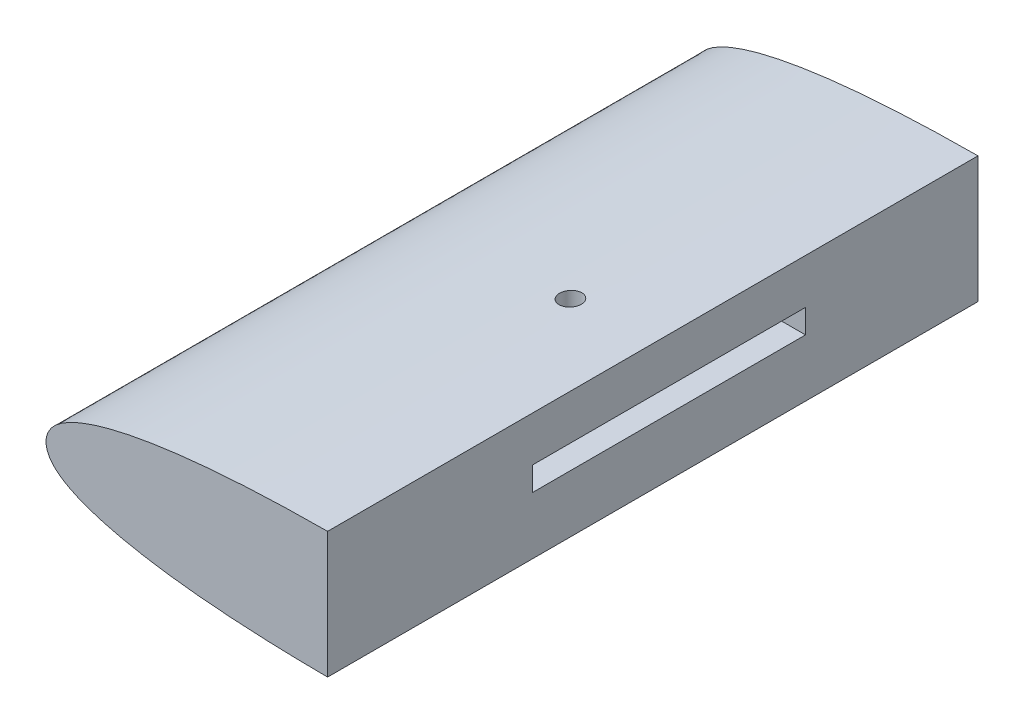
ISO-10303-21;
HEADER;
FILE_DESCRIPTION(('STEP AP214'),'2;1');
FILE_NAME('part.step','',(''),(''),'','','');
FILE_SCHEMA(('AUTOMOTIVE_DESIGN { 1 0 10303 214 1 1 1 1 }'));
ENDSEC;
DATA;
#1=APPLICATION_CONTEXT('core data for automotive mechanical design processes');
#2=APPLICATION_PROTOCOL_DEFINITION('international standard','automotive_design',2000,#1);
#3=PRODUCT_CONTEXT('',#1,'mechanical');
#4=PRODUCT('Part','Part','',(#3));
#5=PRODUCT_RELATED_PRODUCT_CATEGORY('part','',(#4));
#6=PRODUCT_DEFINITION_FORMATION('','',#4);
#7=PRODUCT_DEFINITION_CONTEXT('part definition',#1,'design');
#8=PRODUCT_DEFINITION('design','',#6,#7);
#9=PRODUCT_DEFINITION_SHAPE('','',#8);
#10=(LENGTH_UNIT() NAMED_UNIT(*) SI_UNIT(.MILLI.,.METRE.));
#11=(NAMED_UNIT(*) PLANE_ANGLE_UNIT() SI_UNIT($,.RADIAN.));
#12=(NAMED_UNIT(*) SI_UNIT($,.STERADIAN.) SOLID_ANGLE_UNIT());
#13=UNCERTAINTY_MEASURE_WITH_UNIT(LENGTH_MEASURE(1.E-05),#10,'distance_accuracy_value','');
#14=(GEOMETRIC_REPRESENTATION_CONTEXT(3) GLOBAL_UNCERTAINTY_ASSIGNED_CONTEXT((#13)) GLOBAL_UNIT_ASSIGNED_CONTEXT((#10,
#11,#12)) REPRESENTATION_CONTEXT('',''));
#15=CARTESIAN_POINT('',(0.,0.,0.));
#16=DIRECTION('',(0.,0.,1.));
#17=DIRECTION('',(1.,0.,0.));
#18=AXIS2_PLACEMENT_3D('',#15,#16,#17);
#19=CARTESIAN_POINT('',(64.9490601417906,14.5585390016991,150.01));
#20=DIRECTION('',(1.,0.,0.));
#21=DIRECTION('',(0.,0.,-1.));
#22=AXIS2_PLACEMENT_3D('',#19,#20,#21);
#23=PLANE('',#22);
#24=DIRECTION('',(0.,-1.,0.));
#25=VECTOR('',#24,1.);
#26=CARTESIAN_POINT('',(64.9490601417906,4.1825749587571,102.784488112027));
#27=LINE('',#26,#25);
#28=CARTESIAN_POINT('',(64.9490601417906,4.1825749587571,102.784488112027));
#29=VERTEX_POINT('',#28);
#30=CARTESIAN_POINT('',(64.9490601417906,-1.3174250412429,102.784488112027));
#31=VERTEX_POINT('',#30);
#32=EDGE_CURVE('E56',#29,#31,#27,.T.);
#33=ORIENTED_EDGE('',*,*,#32,.F.);
#34=DIRECTION('',(0.,0.,-1.));
#35=VECTOR('',#34,1.);
#36=CARTESIAN_POINT('',(64.9490601417906,4.1825749587571,102.784488112027));
#37=LINE('',#36,#35);
#38=CARTESIAN_POINT('',(64.9490601417906,4.1825749587571,39.7844881120272));
#39=VERTEX_POINT('',#38);
#40=EDGE_CURVE('E115',#29,#39,#37,.T.);
#41=ORIENTED_EDGE('',*,*,#40,.T.);
#42=DIRECTION('',(0.,-1.,0.));
#43=VECTOR('',#42,1.);
#44=CARTESIAN_POINT('',(64.9490601417906,4.1825749587571,39.7844881120272));
#45=LINE('',#44,#43);
#46=CARTESIAN_POINT('',(64.9490601417906,-1.3174250412429,39.7844881120272));
#47=VERTEX_POINT('',#46);
#48=EDGE_CURVE('E119',#39,#47,#45,.T.);
#49=ORIENTED_EDGE('',*,*,#48,.T.);
#50=DIRECTION('',(0.,0.,-1.));
#51=VECTOR('',#50,1.);
#52=CARTESIAN_POINT('',(64.9490601417906,-1.3174250412429,102.784488112027));
#53=LINE('',#52,#51);
#54=EDGE_CURVE('E135',#31,#47,#53,.T.);
#55=ORIENTED_EDGE('',*,*,#54,.F.);
#56=EDGE_LOOP('',(#33,#41,#49,#55));
#57=FACE_BOUND('',#56,.T.);
#58=DIRECTION('',(0.,1.,0.));
#59=VECTOR('',#58,1.);
#60=CARTESIAN_POINT('',(64.9490601417906,2.03901631355602E-13,150.));
#61=LINE('',#60,#59);
#62=CARTESIAN_POINT('',(64.9490601417907,-14.5585390016991,150.));
#63=VERTEX_POINT('',#62);
#64=CARTESIAN_POINT('',(64.9490601417906,14.5585390016991,150.));
#65=VERTEX_POINT('',#64);
#66=EDGE_CURVE('E63',#63,#65,#61,.T.);
#67=ORIENTED_EDGE('',*,*,#66,.F.);
#68=DIRECTION('',(0.,0.,-1.));
#69=VECTOR('',#68,1.);
#70=CARTESIAN_POINT('',(64.9490601417906,-14.5585390016991,150.));
#71=LINE('',#70,#69);
#72=CARTESIAN_POINT('',(64.9490601417907,-14.5585390016991,0.));
#73=VERTEX_POINT('',#72);
#74=EDGE_CURVE('E213',#63,#73,#71,.T.);
#75=ORIENTED_EDGE('',*,*,#74,.T.);
#76=DIRECTION('',(0.,1.,0.));
#77=VECTOR('',#76,1.);
#78=CARTESIAN_POINT('',(64.9490601417906,2.03901631355602E-13,0.));
#79=LINE('',#78,#77);
#80=CARTESIAN_POINT('',(64.9490601417906,14.5585390016991,0.));
#81=VERTEX_POINT('',#80);
#82=EDGE_CURVE('E144',#73,#81,#79,.T.);
#83=ORIENTED_EDGE('',*,*,#82,.T.);
#84=DIRECTION('',(0.,0.,-1.));
#85=VECTOR('',#84,1.);
#86=CARTESIAN_POINT('',(64.9490601417906,14.5585390016991,150.));
#87=LINE('',#86,#85);
#88=EDGE_CURVE('E210',#81,#65,#87,.F.);
#89=ORIENTED_EDGE('',*,*,#88,.T.);
#90=EDGE_LOOP('',(#67,#75,#83,#89));
#91=FACE_BOUND('',#90,.T.);
#92=ADVANCED_FACE('F39',(#57,#91),#23,.T.);
#93=CARTESIAN_POINT('',(0.,2.03901631355602E-13,0.));
#94=DIRECTION('',(0.,0.,1.));
#95=DIRECTION('',(1.,0.,0.));
#96=AXIS2_PLACEMENT_3D('',#93,#94,#95);
#97=PLANE('',#96);
#98=ORIENTED_EDGE('',*,*,#82,.F.);
#99=CARTESIAN_POINT('',(300.,0.615,0.));
#100=CARTESIAN_POINT('',(297.904984083785,0.75175754308859,0.));
#101=CARTESIAN_POINT('',(292.317834146917,1.11647310076999,0.));
#102=CARTESIAN_POINT('',(283.239167485548,1.717548993117,0.));
#103=CARTESIAN_POINT('',(272.76385107331,2.40173412883395,0.));
#104=CARTESIAN_POINT('',(262.289009769235,3.09314837150869,0.));
#105=CARTESIAN_POINT('',(251.814135815064,3.78406655140474,0.));
#106=CARTESIAN_POINT('',(241.337843931188,4.46862529985887,0.));
#107=CARTESIAN_POINT('',(230.862161265605,5.16145375899976,0.));
#108=CARTESIAN_POINT('',(220.385838201456,5.84553816170969,0.));
#109=CARTESIAN_POINT('',(209.911154414138,6.53834924156426,0.));
#110=CARTESIAN_POINT('',(199.435845553229,7.22265025326787,0.));
#111=CARTESIAN_POINT('',(188.961161961777,7.91546436518573,0.));
#112=CARTESIAN_POINT('',(178.484838114123,8.59953663901671,0.));
#113=CARTESIAN_POINT('',(168.010154067309,9.29234472619852,0.));
#114=CARTESIAN_POINT('',(157.534847027507,9.97666983236351,0.));
#115=CARTESIAN_POINT('',(147.06015640951,10.6693905377389,0.));
#116=CARTESIAN_POINT('',(136.583858847943,11.3538123568298,0.));
#117=CARTESIAN_POINT('',(126.108081002565,12.0453815229781,0.));
#118=CARTESIAN_POINT('',(115.628989204461,12.7348475775842,0.));
#119=CARTESIAN_POINT('',(106.544413863488,13.3187717638727,0.));
#120=CARTESIAN_POINT('',(98.151476206991,13.7592616634662,0.));
#121=CARTESIAN_POINT('',(91.1565623688358,14.0750535449349,0.));
#122=CARTESIAN_POINT('',(83.4590911030426,14.3326710084469,0.));
#123=CARTESIAN_POINT('',(76.8097627687469,14.4942663264378,0.));
#124=CARTESIAN_POINT('',(71.208103954924,14.5530438963208,0.));
#125=CARTESIAN_POINT('',(68.0570107705436,14.5648415354949,0.));
#126=CARTESIAN_POINT('',(65.9559846118634,14.5661361460291,0.));
#127=CARTESIAN_POINT('',(63.5049428575731,14.5483076615896,0.));
#128=CARTESIAN_POINT('',(58.9501852432483,14.5072274097355,0.));
#129=CARTESIAN_POINT('',(52.6393729328738,14.3421780252763,0.));
#130=CARTESIAN_POINT('',(45.9763950033585,14.0411696911552,0.));
#131=CARTESIAN_POINT('',(40.7142788662388,13.6942708963401,0.));
#132=CARTESIAN_POINT('',(36.8531486122309,13.3715858694841,0.));
#133=CARTESIAN_POINT('',(33.6905280026766,13.0667563353647,0.));
#134=CARTESIAN_POINT('',(30.5256864431676,12.7135928826588,0.));
#135=CARTESIAN_POINT('',(27.3574246256501,12.304603807145,0.));
#136=CARTESIAN_POINT('',(23.8293477768756,11.7731450606675,0.));
#137=CARTESIAN_POINT('',(20.2934490427705,11.1558108117877,0.));
#138=CARTESIAN_POINT('',(16.7526134925339,10.4050388087684,0.));
#139=CARTESIAN_POINT('',(13.9101456800867,9.69526837778904,0.));
#140=CARTESIAN_POINT('',(11.411898728501,8.96894267593932,0.));
#141=CARTESIAN_POINT('',(9.247069544107,8.23912232844403,0.));
#142=CARTESIAN_POINT('',(7.0471016636079,7.37156353291515,0.));
#143=CARTESIAN_POINT('',(5.20436825337569,6.46929823591286,0.));
#144=CARTESIAN_POINT('',(3.70440686726622,5.56696021824286,0.));
#145=CARTESIAN_POINT('',(2.49240630636274,4.6717641181702,0.));
#146=CARTESIAN_POINT('',(0.823776107687222,3.08438944362807,0.));
#147=CARTESIAN_POINT('',(-0.563560510684523,0.,0.));
#148=CARTESIAN_POINT('',(0.823776107687273,-3.08438944362815,0.));
#149=CARTESIAN_POINT('',(2.49240630636272,-4.67176411817019,0.));
#150=CARTESIAN_POINT('',(3.70440686726622,-5.56696021824286,0.));
#151=CARTESIAN_POINT('',(5.20436825337569,-6.46929823591286,0.));
#152=CARTESIAN_POINT('',(7.04710166360792,-7.37156353291516,0.));
#153=CARTESIAN_POINT('',(9.24706954410698,-8.23912232844402,0.));
#154=CARTESIAN_POINT('',(11.411898728501,-8.96894267593932,0.));
#155=CARTESIAN_POINT('',(13.9101456800867,-9.69526837778906,0.));
#156=CARTESIAN_POINT('',(16.7526134925338,-10.4050388087684,0.));
#157=CARTESIAN_POINT('',(20.2934490427705,-11.1558108117877,0.));
#158=CARTESIAN_POINT('',(23.8293477768757,-11.7731450606675,0.));
#159=CARTESIAN_POINT('',(27.35742462565,-12.304603807145,0.));
#160=CARTESIAN_POINT('',(30.5256864431676,-12.7135928826588,0.));
#161=CARTESIAN_POINT('',(33.6905280026766,-13.0667563353647,0.));
#162=CARTESIAN_POINT('',(36.8531486122309,-13.3715858694841,0.));
#163=CARTESIAN_POINT('',(40.7142788662388,-13.6942708963401,0.));
#164=CARTESIAN_POINT('',(45.9763950033586,-14.0411696911552,0.));
#165=CARTESIAN_POINT('',(52.6393729328738,-14.3421780252763,0.));
#166=CARTESIAN_POINT('',(58.9501852432483,-14.5072274097355,0.));
#167=CARTESIAN_POINT('',(63.5049428575731,-14.5483076615896,0.));
#168=CARTESIAN_POINT('',(65.9559846118633,-14.5661361460291,0.));
#169=CARTESIAN_POINT('',(68.0570107705436,-14.5648415354949,0.));
#170=CARTESIAN_POINT('',(71.208103954924,-14.5530438963208,0.));
#171=CARTESIAN_POINT('',(76.8097627687469,-14.4942663264378,0.));
#172=CARTESIAN_POINT('',(83.4590911030426,-14.3326710084469,0.));
#173=CARTESIAN_POINT('',(91.1565623688358,-14.0750535449349,0.));
#174=CARTESIAN_POINT('',(98.151476206991,-13.7592616634662,0.));
#175=CARTESIAN_POINT('',(106.544413863488,-13.3187717638727,0.));
#176=CARTESIAN_POINT('',(115.628989204461,-12.7348475775842,0.));
#177=CARTESIAN_POINT('',(126.108081002565,-12.0453815229782,0.));
#178=CARTESIAN_POINT('',(136.583858847943,-11.3538123568298,0.));
#179=CARTESIAN_POINT('',(147.06015640951,-10.6693905377389,0.));
#180=CARTESIAN_POINT('',(157.534847027507,-9.97666983236352,0.));
#181=CARTESIAN_POINT('',(168.010154067309,-9.29234472619851,0.));
#182=CARTESIAN_POINT('',(178.484838114123,-8.59953663901672,0.));
#183=CARTESIAN_POINT('',(188.961161961777,-7.91546436518573,0.));
#184=CARTESIAN_POINT('',(199.435845553229,-7.22265025326786,0.));
#185=CARTESIAN_POINT('',(209.911154414138,-6.53834924156426,0.));
#186=CARTESIAN_POINT('',(220.385838201456,-5.84553816170969,0.));
#187=CARTESIAN_POINT('',(230.862161265605,-5.16145375899976,0.));
#188=CARTESIAN_POINT('',(241.337843931188,-4.46862529985887,0.));
#189=CARTESIAN_POINT('',(251.814135815064,-3.78406655140474,0.));
#190=CARTESIAN_POINT('',(262.289009769236,-3.09314837150869,0.));
#191=CARTESIAN_POINT('',(272.76385107331,-2.40173412883395,0.));
#192=CARTESIAN_POINT('',(283.239167485548,-1.71754899311699,0.));
#193=CARTESIAN_POINT('',(292.317834146917,-1.11647310077,0.));
#194=CARTESIAN_POINT('',(297.904984083785,-0.75175754308859,0.));
#195=CARTESIAN_POINT('',(300.,-0.615,0.));
#196=B_SPLINE_CURVE_WITH_KNOTS('',3,(#99,#100,#101,#102,#103,#104,#105,#106,#107,#108,#109,#110,
#111,#112,#113,#114,#115,#116,#117,#118,#119,#120,#121,#122,#123,#124,#125,#126,#127,#128,#129,
#130,#131,#132,#133,#134,#135,#136,#137,#138,#139,#140,#141,#142,#143,#144,#145,#146,#147,#148,
#149,#150,#151,#152,#153,#154,#155,#156,#157,#158,#159,#160,#161,#162,#163,#164,#165,#166,#167,
#168,#169,#170,#171,#172,#173,#174,#175,#176,#177,#178,#179,#180,#181,#182,#183,#184,#185,#186,
#187,#188,#189,#190,#191,#192,#193,#194,#195),.UNSPECIFIED.,.F.,.F.,(4,1,1,1,1,1,1,1,1,1,1,1,1,
1,1,1,1,1,1,1,1,1,1,1,1,1,1,1,1,1,1,1,1,1,1,1,1,1,1,1,1,1,1,1,1,1,1,1,1,1,1,1,1,1,1,1,1,1,1,1,1,
1,1,1,1,1,1,1,1,1,1,1,1,1,1,1,1,1,1,1,1,1,1,1,1,1,1,1,1,1,1,1,1,1,4),(0.,0.0103317667258092,
0.0275535519148415,0.0447750143759933,0.0619918890878921,0.0792136742769245,0.0964351367380763,
0.113656921927109,0.13087838438826,0.148100169577293,0.165316721469263,0.182538506658296,
0.199759969119447,0.21698175430848,0.23419830620045,0.251420091389483,0.268641553850634,
0.285863339039667,0.303084801500818,0.320322147091687,0.330661096781363,0.344443905301423,
0.354779243630488,0.368562091684667,0.377174559088726,0.382346693571461,0.384069085539591,
0.387513925716762,0.394408809862741,0.406484297575228,0.418578438098915,0.427229264414947,
0.432434171748687,0.437645263639366,0.442864528340028,0.448104781667718,0.453364927121588,
0.460421620890769,0.465764878525566,0.47117403778509,0.474835155867093,0.478565393973049,
0.482412614605373,0.486466494475071,0.488643966308192,0.49102188077919,0.493857902158305,0.5,
0.506142097841696,0.50897811922081,0.511356033691808,0.513533505524929,0.517587385394628,
0.521434606026952,0.525164844132907,0.52882596221491,0.534235121474435,0.539578379109231,
0.546635072878412,0.551895218332282,0.557135471659973,0.562354736360635,0.567565828251314,
0.572770735585054,0.581421561901085,0.593515702424773,0.605591190137259,0.612486074283239,
0.615930914460409,0.617653306428539,0.622825440911274,0.631437908315334,0.645220756369513,
0.655556094698577,0.669338903218637,0.679677852908314,0.696915198499182,0.714136660960334,
0.731358446149366,0.748579908610518,0.76580169379955,0.783018245691521,0.800240030880553,
0.817461493341705,0.834683278530737,0.851899830422708,0.86912161561174,0.886343078072892,
0.903564863261924,0.920786325723076,0.938008110912108,0.955224985624007,0.972446448085159,
0.989668233274191,1.),.UNSPECIFIED.);
#197=EDGE_CURVE('E12',#81,#73,#196,.T.);
#198=ORIENTED_EDGE('',*,*,#197,.F.);
#199=EDGE_LOOP('',(#98,#198));
#200=FACE_BOUND('',#199,.T.);
#201=ADVANCED_FACE('F163',(#200),#97,.F.);
#202=CARTESIAN_POINT('',(300.,0.615,150.));
#203=CARTESIAN_POINT('',(297.904984083785,0.75175754308859,150.));
#204=CARTESIAN_POINT('',(292.317834146917,1.11647310076999,150.));
#205=CARTESIAN_POINT('',(283.239167485548,1.717548993117,150.));
#206=CARTESIAN_POINT('',(272.76385107331,2.40173412883395,150.));
#207=CARTESIAN_POINT('',(262.289009769235,3.09314837150869,150.));
#208=CARTESIAN_POINT('',(251.814135815064,3.78406655140474,150.));
#209=CARTESIAN_POINT('',(241.337843931188,4.46862529985887,150.));
#210=CARTESIAN_POINT('',(230.862161265605,5.16145375899976,150.));
#211=CARTESIAN_POINT('',(220.385838201456,5.84553816170969,150.));
#212=CARTESIAN_POINT('',(209.911154414138,6.53834924156426,150.));
#213=CARTESIAN_POINT('',(199.435845553229,7.22265025326787,150.));
#214=CARTESIAN_POINT('',(188.961161961777,7.91546436518573,150.));
#215=CARTESIAN_POINT('',(178.484838114123,8.59953663901671,150.));
#216=CARTESIAN_POINT('',(168.010154067309,9.29234472619852,150.));
#217=CARTESIAN_POINT('',(157.534847027507,9.97666983236351,150.));
#218=CARTESIAN_POINT('',(147.06015640951,10.6693905377389,150.));
#219=CARTESIAN_POINT('',(136.583858847943,11.3538123568298,150.));
#220=CARTESIAN_POINT('',(126.108081002565,12.0453815229781,150.));
#221=CARTESIAN_POINT('',(115.628989204461,12.7348475775842,150.));
#222=CARTESIAN_POINT('',(106.544413863488,13.3187717638727,150.));
#223=CARTESIAN_POINT('',(98.151476206991,13.7592616634662,150.));
#224=CARTESIAN_POINT('',(91.1565623688358,14.0750535449349,150.));
#225=CARTESIAN_POINT('',(83.4590911030426,14.3326710084469,150.));
#226=CARTESIAN_POINT('',(76.8097627687469,14.4942663264378,150.));
#227=CARTESIAN_POINT('',(71.208103954924,14.5530438963208,150.));
#228=CARTESIAN_POINT('',(68.0570107705436,14.5648415354949,150.));
#229=CARTESIAN_POINT('',(65.9559846118634,14.5661361460291,150.));
#230=CARTESIAN_POINT('',(63.5049428575731,14.5483076615896,150.));
#231=CARTESIAN_POINT('',(58.9501852432483,14.5072274097355,150.));
#232=CARTESIAN_POINT('',(52.6393729328738,14.3421780252763,150.));
#233=CARTESIAN_POINT('',(45.9763950033585,14.0411696911552,150.));
#234=CARTESIAN_POINT('',(40.7142788662388,13.6942708963401,150.));
#235=CARTESIAN_POINT('',(36.8531486122309,13.3715858694841,150.));
#236=CARTESIAN_POINT('',(33.6905280026766,13.0667563353647,150.));
#237=CARTESIAN_POINT('',(30.5256864431676,12.7135928826588,150.));
#238=CARTESIAN_POINT('',(27.3574246256501,12.304603807145,150.));
#239=CARTESIAN_POINT('',(23.8293477768756,11.7731450606675,150.));
#240=CARTESIAN_POINT('',(20.2934490427705,11.1558108117877,150.));
#241=CARTESIAN_POINT('',(16.7526134925339,10.4050388087684,150.));
#242=CARTESIAN_POINT('',(13.9101456800867,9.69526837778904,150.));
#243=CARTESIAN_POINT('',(11.411898728501,8.96894267593932,150.));
#244=CARTESIAN_POINT('',(9.247069544107,8.23912232844403,150.));
#245=CARTESIAN_POINT('',(7.0471016636079,7.37156353291515,150.));
#246=CARTESIAN_POINT('',(5.20436825337569,6.46929823591286,150.));
#247=CARTESIAN_POINT('',(3.70440686726622,5.56696021824286,150.));
#248=CARTESIAN_POINT('',(2.49240630636274,4.6717641181702,150.));
#249=CARTESIAN_POINT('',(0.823776107687222,3.08438944362807,150.));
#250=CARTESIAN_POINT('',(-0.563560510684523,0.,150.));
#251=CARTESIAN_POINT('',(0.823776107687273,-3.08438944362815,150.));
#252=CARTESIAN_POINT('',(2.49240630636272,-4.67176411817019,150.));
#253=CARTESIAN_POINT('',(3.70440686726622,-5.56696021824286,150.));
#254=CARTESIAN_POINT('',(5.20436825337569,-6.46929823591286,150.));
#255=CARTESIAN_POINT('',(7.04710166360792,-7.37156353291516,150.));
#256=CARTESIAN_POINT('',(9.24706954410698,-8.23912232844402,150.));
#257=CARTESIAN_POINT('',(11.411898728501,-8.96894267593932,150.));
#258=CARTESIAN_POINT('',(13.9101456800867,-9.69526837778906,150.));
#259=CARTESIAN_POINT('',(16.7526134925338,-10.4050388087684,150.));
#260=CARTESIAN_POINT('',(20.2934490427705,-11.1558108117877,150.));
#261=CARTESIAN_POINT('',(23.8293477768757,-11.7731450606675,150.));
#262=CARTESIAN_POINT('',(27.35742462565,-12.304603807145,150.));
#263=CARTESIAN_POINT('',(30.5256864431676,-12.7135928826588,150.));
#264=CARTESIAN_POINT('',(33.6905280026766,-13.0667563353647,150.));
#265=CARTESIAN_POINT('',(36.8531486122309,-13.3715858694841,150.));
#266=CARTESIAN_POINT('',(40.7142788662388,-13.6942708963401,150.));
#267=CARTESIAN_POINT('',(45.9763950033586,-14.0411696911552,150.));
#268=CARTESIAN_POINT('',(52.6393729328738,-14.3421780252763,150.));
#269=CARTESIAN_POINT('',(58.9501852432483,-14.5072274097355,150.));
#270=CARTESIAN_POINT('',(63.5049428575731,-14.5483076615896,150.));
#271=CARTESIAN_POINT('',(65.9559846118633,-14.5661361460291,150.));
#272=CARTESIAN_POINT('',(68.0570107705436,-14.5648415354949,150.));
#273=CARTESIAN_POINT('',(71.208103954924,-14.5530438963208,150.));
#274=CARTESIAN_POINT('',(76.8097627687469,-14.4942663264378,150.));
#275=CARTESIAN_POINT('',(83.4590911030426,-14.3326710084469,150.));
#276=CARTESIAN_POINT('',(91.1565623688358,-14.0750535449349,150.));
#277=CARTESIAN_POINT('',(98.151476206991,-13.7592616634662,150.));
#278=CARTESIAN_POINT('',(106.544413863488,-13.3187717638727,150.));
#279=CARTESIAN_POINT('',(115.628989204461,-12.7348475775842,150.));
#280=CARTESIAN_POINT('',(126.108081002565,-12.0453815229782,150.));
#281=CARTESIAN_POINT('',(136.583858847943,-11.3538123568298,150.));
#282=CARTESIAN_POINT('',(147.06015640951,-10.6693905377389,150.));
#283=CARTESIAN_POINT('',(157.534847027507,-9.97666983236352,150.));
#284=CARTESIAN_POINT('',(168.010154067309,-9.29234472619851,150.));
#285=CARTESIAN_POINT('',(178.484838114123,-8.59953663901672,150.));
#286=CARTESIAN_POINT('',(188.961161961777,-7.91546436518573,150.));
#287=CARTESIAN_POINT('',(199.435845553229,-7.22265025326786,150.));
#288=CARTESIAN_POINT('',(209.911154414138,-6.53834924156426,150.));
#289=CARTESIAN_POINT('',(220.385838201456,-5.84553816170969,150.));
#290=CARTESIAN_POINT('',(230.862161265605,-5.16145375899976,150.));
#291=CARTESIAN_POINT('',(241.337843931188,-4.46862529985887,150.));
#292=CARTESIAN_POINT('',(251.814135815064,-3.78406655140474,150.));
#293=CARTESIAN_POINT('',(262.289009769236,-3.09314837150869,150.));
#294=CARTESIAN_POINT('',(272.76385107331,-2.40173412883395,150.));
#295=CARTESIAN_POINT('',(283.239167485548,-1.71754899311699,150.));
#296=CARTESIAN_POINT('',(292.317834146917,-1.11647310077,150.));
#297=CARTESIAN_POINT('',(297.904984083785,-0.75175754308859,150.));
#298=CARTESIAN_POINT('',(300.,-0.615,150.));
#299=B_SPLINE_CURVE_WITH_KNOTS('',3,(#202,#203,#204,#205,#206,#207,#208,#209,#210,#211,#212,
#213,#214,#215,#216,#217,#218,#219,#220,#221,#222,#223,#224,#225,#226,#227,#228,#229,#230,#231,
#232,#233,#234,#235,#236,#237,#238,#239,#240,#241,#242,#243,#244,#245,#246,#247,#248,#249,#250,
#251,#252,#253,#254,#255,#256,#257,#258,#259,#260,#261,#262,#263,#264,#265,#266,#267,#268,#269,
#270,#271,#272,#273,#274,#275,#276,#277,#278,#279,#280,#281,#282,#283,#284,#285,#286,#287,#288,
#289,#290,#291,#292,#293,#294,#295,#296,#297,#298),.UNSPECIFIED.,.F.,.F.,(4,1,1,1,1,1,1,1,1,1,1,
1,1,1,1,1,1,1,1,1,1,1,1,1,1,1,1,1,1,1,1,1,1,1,1,1,1,1,1,1,1,1,1,1,1,1,1,1,1,1,1,1,1,1,1,1,1,1,1,
1,1,1,1,1,1,1,1,1,1,1,1,1,1,1,1,1,1,1,1,1,1,1,1,1,1,1,1,1,1,1,1,1,1,1,4),(0.,0.0103317667258092,
0.0275535519148415,0.0447750143759933,0.0619918890878921,0.0792136742769245,0.0964351367380763,
0.113656921927109,0.13087838438826,0.148100169577293,0.165316721469263,0.182538506658296,
0.199759969119447,0.21698175430848,0.23419830620045,0.251420091389483,0.268641553850634,
0.285863339039667,0.303084801500818,0.320322147091687,0.330661096781363,0.344443905301423,
0.354779243630488,0.368562091684667,0.377174559088726,0.382346693571461,0.384069085539591,
0.387513925716762,0.394408809862741,0.406484297575228,0.418578438098915,0.427229264414947,
0.432434171748687,0.437645263639366,0.442864528340028,0.448104781667718,0.453364927121588,
0.460421620890769,0.465764878525566,0.47117403778509,0.474835155867093,0.478565393973049,
0.482412614605373,0.486466494475071,0.488643966308192,0.49102188077919,0.493857902158305,0.5,
0.506142097841696,0.50897811922081,0.511356033691808,0.513533505524929,0.517587385394628,
0.521434606026952,0.525164844132907,0.52882596221491,0.534235121474435,0.539578379109231,
0.546635072878412,0.551895218332282,0.557135471659973,0.562354736360635,0.567565828251314,
0.572770735585054,0.581421561901085,0.593515702424773,0.605591190137259,0.612486074283239,
0.615930914460409,0.617653306428539,0.622825440911274,0.631437908315334,0.645220756369513,
0.655556094698577,0.669338903218637,0.679677852908314,0.696915198499182,0.714136660960334,
0.731358446149366,0.748579908610518,0.76580169379955,0.783018245691521,0.800240030880553,
0.817461493341705,0.834683278530737,0.851899830422708,0.86912161561174,0.886343078072892,
0.903564863261924,0.920786325723076,0.938008110912108,0.955224985624007,0.972446448085159,
0.989668233274191,1.),.UNSPECIFIED.);
#300=DIRECTION('',(0.,0.,-1.));
#301=VECTOR('',#300,1.);
#302=SURFACE_OF_LINEAR_EXTRUSION('',#299,#301);
#303=CARTESIAN_POINT('',(45.9490601417906,-14.0176386491775,77.5020825488277));
#304=CARTESIAN_POINT('',(46.0897209144716,-14.0253868368941,77.5020763434405));
#305=CARTESIAN_POINT('',(46.230488614377,-14.0330445286574,77.4901816889585));
#306=CARTESIAN_POINT('',(46.5081605372212,-14.0479666551898,77.4428883111153));
#307=CARTESIAN_POINT('',(46.6450599283986,-14.0552306077206,77.4074614397665));
#308=CARTESIAN_POINT('',(46.9109346508887,-14.0691748963265,77.3140977471786));
#309=CARTESIAN_POINT('',(47.0399133952281,-14.0758554843058,77.256170701268));
#310=CARTESIAN_POINT('',(47.2862882908191,-14.0884807014235,77.1194537144376));
#311=CARTESIAN_POINT('',(47.4036873367914,-14.0944255145877,77.0406690058011));
#312=CARTESIAN_POINT('',(47.6235159276555,-14.1054523544723,76.8645208787914));
#313=CARTESIAN_POINT('',(47.7259559489444,-14.1105349854202,76.7671705738942));
#314=CARTESIAN_POINT('',(47.9130405919601,-14.1197444009245,76.5566093755026));
#315=CARTESIAN_POINT('',(47.9976846266407,-14.1238711539492,76.4433979589941));
#316=CARTESIAN_POINT('',(48.1466548699108,-14.1310902464976,76.2044862438827));
#317=CARTESIAN_POINT('',(48.2110067687031,-14.1341838942461,76.0788020034316));
#318=CARTESIAN_POINT('',(48.3176983032149,-14.1392924690023,75.8183940440612));
#319=CARTESIAN_POINT('',(48.360038111726,-14.1413074044776,75.6836703961094));
#320=CARTESIAN_POINT('',(48.4214638820707,-14.1442253244231,75.4091477109214));
#321=CARTESIAN_POINT('',(48.4405722552767,-14.1451293805679,75.2693536993896));
#322=CARTESIAN_POINT('',(48.4550633773709,-14.1458152871298,74.9885390311026));
#323=CARTESIAN_POINT('',(48.4504462462044,-14.1455971432201,74.8475183805524));
#324=CARTESIAN_POINT('',(48.4176257723753,-14.1440423059422,74.5683171905966));
#325=CARTESIAN_POINT('',(48.3894325703912,-14.142706093484,74.4301354562768));
#326=CARTESIAN_POINT('',(48.3102787414955,-14.1389363506212,74.1604703754758));
#327=CARTESIAN_POINT('',(48.2593180945209,-14.1365028192496,74.0289870348976));
#328=CARTESIAN_POINT('',(48.1360719469559,-14.130576908676,73.7764211921134));
#329=CARTESIAN_POINT('',(48.0637822895346,-14.1270843230704,73.6553407232778));
#330=CARTESIAN_POINT('',(47.8999433440325,-14.1190999415678,73.427036706416));
#331=CARTESIAN_POINT('',(47.8083940034273,-14.114608142946,73.3198131961814));
#332=CARTESIAN_POINT('',(47.608563212817,-14.1047036872157,73.1221740188652));
#333=CARTESIAN_POINT('',(47.5002687336804,-14.0992903127094,73.0317715617074));
#334=CARTESIAN_POINT('',(47.27008041242,-14.0876527832398,72.8704278470108));
#335=CARTESIAN_POINT('',(47.1481864876994,-14.0814286233522,72.7994867076799));
#336=CARTESIAN_POINT('',(46.8941078406261,-14.0682964333776,72.678988547517));
#337=CARTESIAN_POINT('',(46.7619110937811,-14.0613876015734,72.6294569687742));
#338=CARTESIAN_POINT('',(46.4911051024311,-14.0470553907403,72.5532901428532));
#339=CARTESIAN_POINT('',(46.3524958120297,-14.0396320080284,72.5266550595782));
#340=CARTESIAN_POINT('',(46.0726200945169,-14.0244517791747,72.4970065308225));
#341=CARTESIAN_POINT('',(45.9313506392472,-14.0166945382412,72.4940218694205));
#342=CARTESIAN_POINT('',(45.6503240181885,-14.0010704925208,72.5118285042378));
#343=CARTESIAN_POINT('',(45.5105668608113,-13.993203687125,72.5326199326386));
#344=CARTESIAN_POINT('',(45.2364269706417,-13.9775899298009,72.5974133091848));
#345=CARTESIAN_POINT('',(45.1020481579629,-13.9698430677295,72.6414318669765));
#346=CARTESIAN_POINT('',(44.8425872212326,-13.9547211190516,72.7514470088365));
#347=CARTESIAN_POINT('',(44.7175051002434,-13.9473460325676,72.8174436001439));
#348=CARTESIAN_POINT('',(44.4802283987133,-13.9332183524893,72.9695314130432));
#349=CARTESIAN_POINT('',(44.368030338141,-13.9264655909005,73.0556171893346));
#350=CARTESIAN_POINT('',(44.1596832632266,-13.9138208967737,73.2454603836487));
#351=CARTESIAN_POINT('',(44.0635341551688,-13.907928959209,73.3492176984738));
#352=CARTESIAN_POINT('',(43.8901539491646,-13.8972329868614,73.571314304746));
#353=CARTESIAN_POINT('',(43.8128977363068,-13.8924275084636,73.6896339198684));
#354=CARTESIAN_POINT('',(43.6793530073332,-13.884080316099,73.9376077861572));
#355=CARTESIAN_POINT('',(43.6230642467322,-13.8805385873966,74.0672619051389));
#356=CARTESIAN_POINT('',(43.5331573492862,-13.8748651338548,74.33396818397));
#357=CARTESIAN_POINT('',(43.4994976331178,-13.8727308231199,74.4710062728526));
#358=CARTESIAN_POINT('',(43.4556509262289,-13.8699481351354,74.7488021750163));
#359=CARTESIAN_POINT('',(43.4454637662719,-13.8692997471723,74.8895599614711));
#360=CARTESIAN_POINT('',(43.4488530456467,-13.8695152140969,75.1705996252298));
#361=CARTESIAN_POINT('',(43.4623978566957,-13.8703770562575,75.31088188668));
#362=CARTESIAN_POINT('',(43.5128005277072,-13.8735739971564,75.587176184484));
#363=CARTESIAN_POINT('',(43.5496583927242,-13.875909096214,75.723188219912));
#364=CARTESIAN_POINT('',(43.6456305502706,-13.8819585717478,75.9870882801327));
#365=CARTESIAN_POINT('',(43.7047452354278,-13.8856729725559,76.1149761615624));
#366=CARTESIAN_POINT('',(43.8435380888315,-13.8943344081116,76.3590058011714));
#367=CARTESIAN_POINT('',(43.9232155760108,-13.899281402034,76.4751479482076));
#368=CARTESIAN_POINT('',(44.1009735519765,-13.9102254751616,76.6925524413708));
#369=CARTESIAN_POINT('',(44.1990764002601,-13.9162238296144,76.7937964392671));
#370=CARTESIAN_POINT('',(44.4108636892766,-13.9290472140943,76.9784097237044));
#371=CARTESIAN_POINT('',(44.5245521407499,-13.935872456857,77.0617743950399));
#372=CARTESIAN_POINT('',(44.7645310152029,-13.9501239054825,77.2084239302288));
#373=CARTESIAN_POINT('',(44.8908500099635,-13.9575514663503,77.2716618498488));
#374=CARTESIAN_POINT('',(45.1521950509067,-13.9727401778388,77.3759573600761));
#375=CARTESIAN_POINT('',(45.2872105556195,-13.9805009209226,77.4170412586545));
#376=CARTESIAN_POINT('',(45.5107413292491,-13.9931950484677,77.4649690327195));
#377=CARTESIAN_POINT('',(45.5978083794362,-13.998102843403,77.4788690193679));
#378=CARTESIAN_POINT('',(45.7729230208839,-14.0078984726659,77.497427725241));
#379=CARTESIAN_POINT('',(45.8609706131507,-14.0127863069732,77.5020864349832));
#380=CARTESIAN_POINT('',(45.9490601417906,-14.0176386491775,77.5020825488277));
#381=B_SPLINE_CURVE_WITH_KNOTS('',3,(#303,#304,#305,#306,#307,#308,#309,#310,#311,#312,#313,
#314,#315,#316,#317,#318,#319,#320,#321,#322,#323,#324,#325,#326,#327,#328,#329,#330,#331,#332,
#333,#334,#335,#336,#337,#338,#339,#340,#341,#342,#343,#344,#345,#346,#347,#348,#349,#350,#351,
#352,#353,#354,#355,#356,#357,#358,#359,#360,#361,#362,#363,#364,#365,#366,#367,#368,#369,#370,
#371,#372,#373,#374,#375,#376,#377,#378,#379,#380),.UNSPECIFIED.,.T.,.F.,(4,2,2,2,2,2,2,2,2,2,2,
2,2,2,2,2,2,2,2,2,2,2,2,2,2,2,2,2,2,2,2,2,2,2,2,2,2,2,4),(0.,0.422300413511189,
0.845106872158028,1.26772984523249,1.69024690081741,2.11246661703485,2.53470025906496,
2.95639717947454,3.37809078957455,3.7993772681008,4.22066161679646,4.64176485333528,
5.06286846095706,5.48405419212801,5.90524107195514,6.32675733532367,6.74827615892594,
7.17029452715089,7.59231591634459,8.01485085384002,8.43738814040049,8.86022799233077,
9.28306798353899,9.70579349415322,10.1285165362344,10.5506745470026,10.9728276351619,
11.3942029102331,11.8155751471912,12.236386236284,12.6571974166142,13.0780160207331,
13.4988206885739,13.9201393488556,14.3415666339314,14.7639697848758,15.1858702198746,
15.4503377433335,15.714805538168),.UNSPECIFIED.);
#382=CARTESIAN_POINT('',(45.9490601417906,-14.0176386491775,77.5020825488277));
#383=VERTEX_POINT('',#382);
#384=EDGE_CURVE('E122',#383,#383,#381,.T.);
#385=ORIENTED_EDGE('',*,*,#384,.T.);
#386=EDGE_LOOP('',(#385));
#387=FACE_BOUND('',#386,.T.);
#388=CARTESIAN_POINT('',(45.9490601417906,14.0176386491775,77.5020825488277));
#389=CARTESIAN_POINT('',(45.8083213486873,14.0098858811665,77.5020763278901));
#390=CARTESIAN_POINT('',(45.667485711122,14.0020312569076,77.4901684193807));
#391=CARTESIAN_POINT('',(45.389701446485,13.9863509755479,77.4428326836897));
#392=CARTESIAN_POINT('',(45.2527577234865,13.9785253649359,77.4073764448847));
#393=CARTESIAN_POINT('',(44.9868185371758,13.9631561925162,77.3139475284434));
#394=CARTESIAN_POINT('',(44.8578194563462,13.9556125029628,77.2559851878961));
#395=CARTESIAN_POINT('',(44.6114175075172,13.9410549610676,77.1191941391128));
#396=CARTESIAN_POINT('',(44.494011732796,13.9340409760203,77.0403706795962));
#397=CARTESIAN_POINT('',(44.2741420951847,13.9207881361847,76.864111144568));
#398=CARTESIAN_POINT('',(44.1716724828951,13.9145489832767,76.7666822644085));
#399=CARTESIAN_POINT('',(43.9845470215924,13.9030714286459,76.5559442394326));
#400=CARTESIAN_POINT('',(43.8998917403321,13.8978330588191,76.4426345886788));
#401=CARTESIAN_POINT('',(43.7509480397801,13.8885651549103,76.2035469433557));
#402=CARTESIAN_POINT('',(43.6866271594796,13.8845336947183,76.0777892461531));
#403=CARTESIAN_POINT('',(43.5800152395915,13.8778271403038,75.8172255110193));
#404=CARTESIAN_POINT('',(43.5377239145878,13.8751520285085,75.6824195903429));
#405=CARTESIAN_POINT('',(43.4764440935639,13.8712694528868,75.4078457713458));
#406=CARTESIAN_POINT('',(43.4574138941403,13.8700593625532,75.2680872167316));
#407=CARTESIAN_POINT('',(43.4430651321536,13.8691473220515,74.9873539468625));
#408=CARTESIAN_POINT('',(43.4477463568287,13.8694453583509,74.8463792425313));
#409=CARTESIAN_POINT('',(43.4806691046733,13.871536349032,74.5673594470283));
#410=CARTESIAN_POINT('',(43.5088877437454,13.8733278514001,74.4293116438219));
#411=CARTESIAN_POINT('',(43.5880453733322,13.8783313756768,74.1599190211011));
#412=CARTESIAN_POINT('',(43.6389844065602,13.8815434002561,74.0285742141884));
#413=CARTESIAN_POINT('',(43.7621531400773,13.8892619835946,73.7762459315699));
#414=CARTESIAN_POINT('',(43.8343926135453,13.8937691365673,73.6552672450585));
#415=CARTESIAN_POINT('',(43.9980916343132,13.9039027018531,73.4271529446137));
#416=CARTESIAN_POINT('',(44.0895513269569,13.9095291226301,73.3200174353724));
#417=CARTESIAN_POINT('',(44.2892513974168,13.9217006199738,73.1224451731255));
#418=CARTESIAN_POINT('',(44.3975183667452,13.9282471507053,73.0320353881627));
#419=CARTESIAN_POINT('',(44.6276521818959,13.9420172516119,72.8706693887528));
#420=CARTESIAN_POINT('',(44.7495191663553,13.9492408286886,72.7997133726408));
#421=CARTESIAN_POINT('',(45.0036302327094,13.9641324670081,72.6791398380182));
#422=CARTESIAN_POINT('',(45.1358924078955,13.9718012968901,72.6295605446157));
#423=CARTESIAN_POINT('',(45.4068549132509,13.9873250502446,72.5533207670709));
#424=CARTESIAN_POINT('',(45.545555287196,13.9951799749824,72.5266604387876));
#425=CARTESIAN_POINT('',(45.8256126978109,14.0108457627472,72.4969965645412));
#426=CARTESIAN_POINT('',(45.9669723482754,14.0186565714317,72.4940176593169));
#427=CARTESIAN_POINT('',(46.2481953815334,14.0340044881515,72.511870884034));
#428=CARTESIAN_POINT('',(46.3880587627929,14.0415415959064,72.5327030383823));
#429=CARTESIAN_POINT('',(46.6623064124754,14.0561438208451,72.597594708475));
#430=CARTESIAN_POINT('',(46.7966910171555,14.0632089670124,72.6416527964204));
#431=CARTESIAN_POINT('',(47.0561640747168,14.0766968082572,72.7517562564854));
#432=CARTESIAN_POINT('',(47.181252566783,14.0831195060428,72.8178015359177));
#433=CARTESIAN_POINT('',(47.4184541206891,14.0951740703137,72.9699426261887));
#434=CARTESIAN_POINT('',(47.5305791060792,14.1008066645527,73.0560197889684));
#435=CARTESIAN_POINT('',(47.738786396162,14.1111732913305,73.2458220207618));
#436=CARTESIAN_POINT('',(47.8348687984676,14.1159073293367,73.3495469823879));
#437=CARTESIAN_POINT('',(48.0081327142026,14.1243826835249,73.5715602874298));
#438=CARTESIAN_POINT('',(48.0853378587345,14.128125241366,73.6898301413193));
#439=CARTESIAN_POINT('',(48.2187960056012,14.1345604898565,73.9376790471484));
#440=CARTESIAN_POINT('',(48.2750491601416,14.1372531881327,74.0672580169246));
#441=CARTESIAN_POINT('',(48.3649435968708,14.141542486687,74.3338943375663));
#442=CARTESIAN_POINT('',(48.3986095197814,14.1431402814512,74.4709433621247));
#443=CARTESIAN_POINT('',(48.4424652468815,14.1452196691761,74.7487558607537));
#444=CARTESIAN_POINT('',(48.4526551067931,14.1457012647861,74.8895193260069));
#445=CARTESIAN_POINT('',(48.4492682600781,14.1455409869219,75.1706723309247));
#446=CARTESIAN_POINT('',(48.4357061791251,14.1448998048179,75.3110620474238));
#447=CARTESIAN_POINT('',(48.3852313863317,14.1425050617348,75.5875693196339));
#448=CARTESIAN_POINT('',(48.3483186537147,14.140751499766,75.7236868715435));
#449=CARTESIAN_POINT('',(48.2521962254667,14.1361593420336,75.9877900905786));
#450=CARTESIAN_POINT('',(48.1929861384498,14.1333207272239,76.1157756149164));
#451=CARTESIAN_POINT('',(48.05396114437,14.1266050732658,76.3599812502318));
#452=CARTESIAN_POINT('',(47.9741470036398,14.1227280727382,76.4762017985638));
#453=CARTESIAN_POINT('',(47.7961427462224,14.1140011873617,76.6936518187369));
#454=CARTESIAN_POINT('',(47.697943337527,14.1091508104739,76.7948736636098));
#455=CARTESIAN_POINT('',(47.4859588340328,14.098568370255,76.9794217287765));
#456=CARTESIAN_POINT('',(47.3721697981209,14.0928360839289,77.062743410123));
#457=CARTESIAN_POINT('',(47.1320873643841,14.0805997191101,77.2092255702175));
#458=CARTESIAN_POINT('',(47.0057746573249,14.0740944456479,77.2723542613365));
#459=CARTESIAN_POINT('',(46.7444747447027,14.0604694993046,77.3764397899443));
#460=CARTESIAN_POINT('',(46.609498063426,14.0533505683682,77.417422978389));
#461=CARTESIAN_POINT('',(46.3862324969893,14.0414255454414,77.4651646614218));
#462=CARTESIAN_POINT('',(46.2993844787137,14.0367514459472,77.4789920724403));
#463=CARTESIAN_POINT('',(46.124723599367,14.0272776764454,77.4974529603748));
#464=CARTESIAN_POINT('',(46.0369107377406,14.0224780063655,77.5020864320007));
#465=CARTESIAN_POINT('',(45.9490601417906,14.0176386491775,77.5020825488277));
#466=B_SPLINE_CURVE_WITH_KNOTS('',3,(#388,#389,#390,#391,#392,#393,#394,#395,#396,#397,#398,
#399,#400,#401,#402,#403,#404,#405,#406,#407,#408,#409,#410,#411,#412,#413,#414,#415,#416,#417,
#418,#419,#420,#421,#422,#423,#424,#425,#426,#427,#428,#429,#430,#431,#432,#433,#434,#435,#436,
#437,#438,#439,#440,#441,#442,#443,#444,#445,#446,#447,#448,#449,#450,#451,#452,#453,#454,#455,
#456,#457,#458,#459,#460,#461,#462,#463,#464,#465),.UNSPECIFIED.,.T.,.F.,(4,2,2,2,2,2,2,2,2,2,2,
2,2,2,2,2,2,2,2,2,2,2,2,2,2,2,2,2,2,2,2,2,2,2,2,2,2,2,4),(0.,0.422535463297165,0.84558165410259,
1.26843376851189,1.69117959305094,2.11376225721543,2.53635838728732,2.95827645520413,
3.38018905659464,3.80134412277519,4.22249540995147,4.64323771216243,5.06398080535136,
5.48491724727378,5.90585687243903,6.32746940240124,6.74908623062906,7.17145388372165,
7.59382440907724,8.01663435741007,8.43944473913662,8.86222913190412,9.28501174244069,
9.70740233998897,10.1297903673631,10.5516468983762,10.9735003647541,11.3948928738234,
11.8162843826879,12.2374165035749,12.6585489991751,13.0796888872671,13.5008131140326,
13.9221507565105,14.3435951118653,14.7656996730159,15.1873008592791,15.4510516708563,
15.7148026341989),.UNSPECIFIED.);
#467=CARTESIAN_POINT('',(45.9490601417906,14.0176386491775,77.5020825488277));
#468=VERTEX_POINT('',#467);
#469=EDGE_CURVE('E167',#468,#468,#466,.T.);
#470=ORIENTED_EDGE('',*,*,#469,.T.);
#471=EDGE_LOOP('',(#470));
#472=FACE_BOUND('',#471,.T.);
#473=ORIENTED_EDGE('',*,*,#88,.F.);
#474=ORIENTED_EDGE('',*,*,#197,.T.);
#475=ORIENTED_EDGE('',*,*,#74,.F.);
#476=EDGE_CURVE('E49',#65,#63,#299,.T.);
#477=ORIENTED_EDGE('',*,*,#476,.F.);
#478=EDGE_LOOP('',(#473,#474,#475,#477));
#479=FACE_BOUND('',#478,.T.);
#480=ADVANCED_FACE('F159',(#387,#472,#479),#302,.F.);
#481=CARTESIAN_POINT('',(0.,2.03901631355602E-13,150.));
#482=DIRECTION('',(0.,0.,1.));
#483=DIRECTION('',(1.,0.,0.));
#484=AXIS2_PLACEMENT_3D('',#481,#482,#483);
#485=PLANE('',#484);
#486=ORIENTED_EDGE('',*,*,#476,.T.);
#487=ORIENTED_EDGE('',*,*,#66,.T.);
#488=EDGE_LOOP('',(#486,#487));
#489=FACE_BOUND('',#488,.T.);
#490=ADVANCED_FACE('F41',(#489),#485,.T.);
#491=CARTESIAN_POINT('',(36.9490601417906,4.1825749587571,102.784488112027));
#492=DIRECTION('',(0.,0.,1.));
#493=DIRECTION('',(1.,0.,0.));
#494=AXIS2_PLACEMENT_3D('',#491,#492,#493);
#495=PLANE('',#494);
#496=ORIENTED_EDGE('',*,*,#32,.T.);
#497=DIRECTION('',(1.,0.,0.));
#498=VECTOR('',#497,1.);
#499=CARTESIAN_POINT('',(36.9490601417906,-1.3174250412429,102.784488112027));
#500=LINE('',#499,#498);
#501=CARTESIAN_POINT('',(36.9490601417906,-1.3174250412429,102.784488112027));
#502=VERTEX_POINT('',#501);
#503=EDGE_CURVE('E91',#502,#31,#500,.T.);
#504=ORIENTED_EDGE('',*,*,#503,.F.);
#505=DIRECTION('',(0.,-1.,0.));
#506=VECTOR('',#505,1.);
#507=CARTESIAN_POINT('',(36.9490601417906,4.1825749587571,102.784488112027));
#508=LINE('',#507,#506);
#509=CARTESIAN_POINT('',(36.9490601417906,4.1825749587571,102.784488112027));
#510=VERTEX_POINT('',#509);
#511=EDGE_CURVE('E95',#510,#502,#508,.T.);
#512=ORIENTED_EDGE('',*,*,#511,.F.);
#513=DIRECTION('',(1.,0.,0.));
#514=VECTOR('',#513,1.);
#515=CARTESIAN_POINT('',(36.9490601417906,4.1825749587571,102.784488112027));
#516=LINE('',#515,#514);
#517=EDGE_CURVE('E141',#510,#29,#516,.T.);
#518=ORIENTED_EDGE('',*,*,#517,.T.);
#519=EDGE_LOOP('',(#496,#504,#512,#518));
#520=FACE_BOUND('',#519,.T.);
#521=ADVANCED_FACE('F93',(#520),#495,.F.);
#522=CARTESIAN_POINT('',(36.9490601417906,4.1825749587571,102.784488112027));
#523=DIRECTION('',(0.,-1.,0.));
#524=DIRECTION('',(0.,0.,-1.));
#525=AXIS2_PLACEMENT_3D('',#522,#523,#524);
#526=PLANE('',#525);
#527=CARTESIAN_POINT('',(45.9490601417906,4.1825749587571,75.));
#528=DIRECTION('',(0.,-1.,0.));
#529=DIRECTION('',(0.,0.,-1.));
#530=AXIS2_PLACEMENT_3D('',#527,#528,#529);
#531=CIRCLE('',#530,2.50208254882771);
#532=CARTESIAN_POINT('',(45.9490601417906,4.1825749587571,72.4979174511723));
#533=VERTEX_POINT('',#532);
#534=EDGE_CURVE('E174',#533,#533,#531,.T.);
#535=ORIENTED_EDGE('',*,*,#534,.F.);
#536=EDGE_LOOP('',(#535));
#537=FACE_BOUND('',#536,.T.);
#538=ORIENTED_EDGE('',*,*,#40,.F.);
#539=ORIENTED_EDGE('',*,*,#517,.F.);
#540=DIRECTION('',(0.,0.,-1.));
#541=VECTOR('',#540,1.);
#542=CARTESIAN_POINT('',(36.9490601417906,4.1825749587571,102.784488112027));
#543=LINE('',#542,#541);
#544=CARTESIAN_POINT('',(36.9490601417906,4.1825749587571,39.7844881120272));
#545=VERTEX_POINT('',#544);
#546=EDGE_CURVE('E101',#510,#545,#543,.T.);
#547=ORIENTED_EDGE('',*,*,#546,.T.);
#548=DIRECTION('',(1.,0.,0.));
#549=VECTOR('',#548,1.);
#550=CARTESIAN_POINT('',(36.9490601417906,4.1825749587571,39.7844881120272));
#551=LINE('',#550,#549);
#552=EDGE_CURVE('E145',#545,#39,#551,.T.);
#553=ORIENTED_EDGE('',*,*,#552,.T.);
#554=EDGE_LOOP('',(#538,#539,#547,#553));
#555=FACE_BOUND('',#554,.T.);
#556=ADVANCED_FACE('F184',(#537,#555),#526,.T.);
#557=CARTESIAN_POINT('',(36.9490601417906,4.1825749587571,39.7844881120272));
#558=DIRECTION('',(0.,0.,1.));
#559=DIRECTION('',(1.,0.,0.));
#560=AXIS2_PLACEMENT_3D('',#557,#558,#559);
#561=PLANE('',#560);
#562=ORIENTED_EDGE('',*,*,#48,.F.);
#563=ORIENTED_EDGE('',*,*,#552,.F.);
#564=DIRECTION('',(0.,-1.,0.));
#565=VECTOR('',#564,1.);
#566=CARTESIAN_POINT('',(36.9490601417906,4.1825749587571,39.7844881120272));
#567=LINE('',#566,#565);
#568=CARTESIAN_POINT('',(36.9490601417906,-1.3174250412429,39.7844881120272));
#569=VERTEX_POINT('',#568);
#570=EDGE_CURVE('E110',#545,#569,#567,.T.);
#571=ORIENTED_EDGE('',*,*,#570,.T.);
#572=DIRECTION('',(1.,0.,0.));
#573=VECTOR('',#572,1.);
#574=CARTESIAN_POINT('',(36.9490601417906,-1.3174250412429,39.7844881120272));
#575=LINE('',#574,#573);
#576=EDGE_CURVE('E100',#569,#47,#575,.T.);
#577=ORIENTED_EDGE('',*,*,#576,.T.);
#578=EDGE_LOOP('',(#562,#563,#571,#577));
#579=FACE_BOUND('',#578,.T.);
#580=ADVANCED_FACE('F187',(#579),#561,.T.);
#581=CARTESIAN_POINT('',(36.9490601417906,-1.3174250412429,102.784488112027));
#582=DIRECTION('',(0.,-1.,0.));
#583=DIRECTION('',(0.,0.,-1.));
#584=AXIS2_PLACEMENT_3D('',#581,#582,#583);
#585=PLANE('',#584);
#586=CARTESIAN_POINT('',(45.9490601417906,-1.3174250412429,75.));
#587=DIRECTION('',(0.,-1.,0.));
#588=DIRECTION('',(0.,0.,-1.));
#589=AXIS2_PLACEMENT_3D('',#586,#587,#588);
#590=CIRCLE('',#589,2.50208254882771);
#591=CARTESIAN_POINT('',(45.9490601417906,-1.3174250412429,72.4979174511723));
#592=VERTEX_POINT('',#591);
#593=EDGE_CURVE('E43',#592,#592,#590,.T.);
#594=ORIENTED_EDGE('',*,*,#593,.T.);
#595=EDGE_LOOP('',(#594));
#596=FACE_BOUND('',#595,.T.);
#597=ORIENTED_EDGE('',*,*,#54,.T.);
#598=ORIENTED_EDGE('',*,*,#576,.F.);
#599=DIRECTION('',(0.,0.,-1.));
#600=VECTOR('',#599,1.);
#601=CARTESIAN_POINT('',(36.9490601417906,-1.3174250412429,102.784488112027));
#602=LINE('',#601,#600);
#603=EDGE_CURVE('E105',#502,#569,#602,.T.);
#604=ORIENTED_EDGE('',*,*,#603,.F.);
#605=ORIENTED_EDGE('',*,*,#503,.T.);
#606=EDGE_LOOP('',(#597,#598,#604,#605));
#607=FACE_BOUND('',#606,.T.);
#608=ADVANCED_FACE('F106',(#596,#607),#585,.F.);
#609=CARTESIAN_POINT('',(36.9490601417906,0.,0.));
#610=DIRECTION('',(1.,0.,0.));
#611=DIRECTION('',(0.,0.,-1.));
#612=AXIS2_PLACEMENT_3D('',#609,#610,#611);
#613=PLANE('',#612);
#614=ORIENTED_EDGE('',*,*,#511,.T.);
#615=ORIENTED_EDGE('',*,*,#603,.T.);
#616=ORIENTED_EDGE('',*,*,#570,.F.);
#617=ORIENTED_EDGE('',*,*,#546,.F.);
#618=EDGE_LOOP('',(#614,#615,#616,#617));
#619=FACE_BOUND('',#618,.T.);
#620=ADVANCED_FACE('F113',(#619),#613,.T.);
#621=CARTESIAN_POINT('',(45.9490601417906,-14.5585390016991,75.));
#622=DIRECTION('',(0.,1.,0.));
#623=DIRECTION('',(0.,0.,1.));
#624=AXIS2_PLACEMENT_3D('',#621,#622,#623);
#625=CYLINDRICAL_SURFACE('',#624,2.50208254882771);
#626=ORIENTED_EDGE('',*,*,#593,.F.);
#627=EDGE_LOOP('',(#626));
#628=FACE_BOUND('',#627,.T.);
#629=ORIENTED_EDGE('',*,*,#384,.F.);
#630=EDGE_LOOP('',(#629));
#631=FACE_BOUND('',#630,.T.);
#632=ADVANCED_FACE('F175',(#628,#631),#625,.F.);
#633=ORIENTED_EDGE('',*,*,#534,.T.);
#634=EDGE_LOOP('',(#633));
#635=FACE_BOUND('',#634,.T.);
#636=ORIENTED_EDGE('',*,*,#469,.F.);
#637=EDGE_LOOP('',(#636));
#638=FACE_BOUND('',#637,.T.);
#639=ADVANCED_FACE('F179',(#635,#638),#625,.F.);
#640=CLOSED_SHELL('',(#92,#201,#480,#490,#521,#556,#580,#608,#620,#632,#639));
#641=MANIFOLD_SOLID_BREP('B2',#640);
#642=ADVANCED_BREP_SHAPE_REPRESENTATION('',(#18,#641),#14);
#643=SHAPE_DEFINITION_REPRESENTATION(#9,#642);
ENDSEC;
END-ISO-10303-21;
